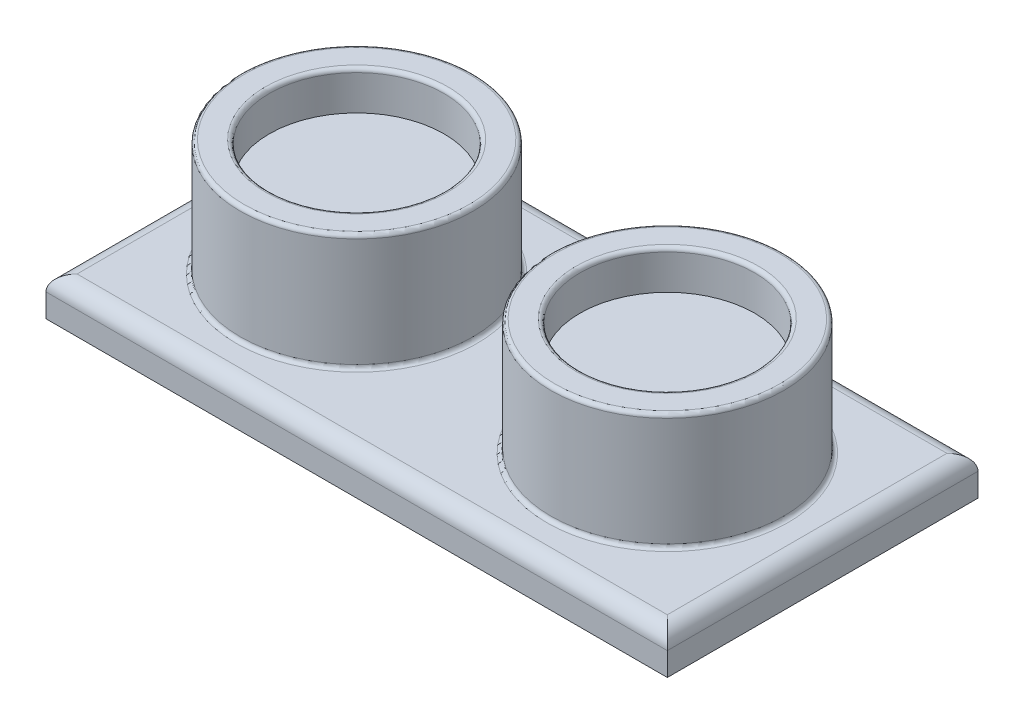
ISO-10303-21;
HEADER;
FILE_DESCRIPTION(('STEP AP214'),'2;1');
FILE_NAME('part.step','',(''),(''),'','','');
FILE_SCHEMA(('AUTOMOTIVE_DESIGN { 1 0 10303 214 1 1 1 1 }'));
ENDSEC;
DATA;
#1=APPLICATION_CONTEXT('core data for automotive mechanical design processes');
#2=APPLICATION_PROTOCOL_DEFINITION('international standard','automotive_design',2000,#1);
#3=PRODUCT_CONTEXT('',#1,'mechanical');
#4=PRODUCT('Part','Part','',(#3));
#5=PRODUCT_RELATED_PRODUCT_CATEGORY('part','',(#4));
#6=PRODUCT_DEFINITION_FORMATION('','',#4);
#7=PRODUCT_DEFINITION_CONTEXT('part definition',#1,'design');
#8=PRODUCT_DEFINITION('design','',#6,#7);
#9=PRODUCT_DEFINITION_SHAPE('','',#8);
#10=(LENGTH_UNIT() NAMED_UNIT(*) SI_UNIT(.MILLI.,.METRE.));
#11=(NAMED_UNIT(*) PLANE_ANGLE_UNIT() SI_UNIT($,.RADIAN.));
#12=(NAMED_UNIT(*) SI_UNIT($,.STERADIAN.) SOLID_ANGLE_UNIT());
#13=UNCERTAINTY_MEASURE_WITH_UNIT(LENGTH_MEASURE(1.E-05),#10,'distance_accuracy_value','');
#14=(GEOMETRIC_REPRESENTATION_CONTEXT(3) GLOBAL_UNCERTAINTY_ASSIGNED_CONTEXT((#13)) GLOBAL_UNIT_ASSIGNED_CONTEXT((#10,
#11,#12)) REPRESENTATION_CONTEXT('',''));
#15=CARTESIAN_POINT('',(0.,0.,0.));
#16=DIRECTION('',(0.,0.,1.));
#17=DIRECTION('',(1.,0.,0.));
#18=AXIS2_PLACEMENT_3D('',#15,#16,#17);
#19=CARTESIAN_POINT('',(40.,5.,-20.));
#20=DIRECTION('',(-1.,0.,0.));
#21=DIRECTION('',(0.,0.,1.));
#22=AXIS2_PLACEMENT_3D('',#19,#20,#21);
#23=PLANE('',#22);
#24=DIRECTION('',(0.,-1.,0.));
#25=VECTOR('',#24,1.);
#26=CARTESIAN_POINT('',(40.,5.,-20.));
#27=LINE('',#26,#25);
#28=CARTESIAN_POINT('',(40.,3.,-20.));
#29=VERTEX_POINT('',#28);
#30=CARTESIAN_POINT('',(40.,0.,-20.));
#31=VERTEX_POINT('',#30);
#32=EDGE_CURVE('E96',#29,#31,#27,.T.);
#33=ORIENTED_EDGE('',*,*,#32,.F.);
#34=DIRECTION('',(0.,0.,-1.));
#35=VECTOR('',#34,1.);
#36=CARTESIAN_POINT('',(40.,3.,20.));
#37=LINE('',#36,#35);
#38=CARTESIAN_POINT('',(40.,3.,20.));
#39=VERTEX_POINT('',#38);
#40=EDGE_CURVE('E155',#29,#39,#37,.F.);
#41=ORIENTED_EDGE('',*,*,#40,.T.);
#42=DIRECTION('',(0.,-1.,0.));
#43=VECTOR('',#42,1.);
#44=CARTESIAN_POINT('',(40.,5.,20.));
#45=LINE('',#44,#43);
#46=CARTESIAN_POINT('',(40.,0.,20.));
#47=VERTEX_POINT('',#46);
#48=EDGE_CURVE('E120',#39,#47,#45,.T.);
#49=ORIENTED_EDGE('',*,*,#48,.T.);
#50=DIRECTION('',(0.,0.,-1.));
#51=VECTOR('',#50,1.);
#52=CARTESIAN_POINT('',(40.,0.,-20.));
#53=LINE('',#52,#51);
#54=EDGE_CURVE('E115',#47,#31,#53,.T.);
#55=ORIENTED_EDGE('',*,*,#54,.T.);
#56=EDGE_LOOP('',(#33,#41,#49,#55));
#57=FACE_BOUND('',#56,.T.);
#58=ADVANCED_FACE('F41',(#57),#23,.F.);
#59=CARTESIAN_POINT('',(-40.,5.,-20.));
#60=DIRECTION('',(0.,0.,1.));
#61=DIRECTION('',(1.,0.,0.));
#62=AXIS2_PLACEMENT_3D('',#59,#60,#61);
#63=PLANE('',#62);
#64=DIRECTION('',(0.,-1.,0.));
#65=VECTOR('',#64,1.);
#66=CARTESIAN_POINT('',(-40.,5.,-20.));
#67=LINE('',#66,#65);
#68=CARTESIAN_POINT('',(-40.,3.,-20.));
#69=VERTEX_POINT('',#68);
#70=CARTESIAN_POINT('',(-40.,0.,-20.));
#71=VERTEX_POINT('',#70);
#72=EDGE_CURVE('E109',#69,#71,#67,.T.);
#73=ORIENTED_EDGE('',*,*,#72,.F.);
#74=DIRECTION('',(-1.,0.,0.));
#75=VECTOR('',#74,1.);
#76=CARTESIAN_POINT('',(40.,3.,-20.));
#77=LINE('',#76,#75);
#78=EDGE_CURVE('E102',#69,#29,#77,.F.);
#79=ORIENTED_EDGE('',*,*,#78,.T.);
#80=ORIENTED_EDGE('',*,*,#32,.T.);
#81=DIRECTION('',(-1.,0.,0.));
#82=VECTOR('',#81,1.);
#83=CARTESIAN_POINT('',(-40.,0.,-20.));
#84=LINE('',#83,#82);
#85=EDGE_CURVE('E99',#31,#71,#84,.T.);
#86=ORIENTED_EDGE('',*,*,#85,.T.);
#87=EDGE_LOOP('',(#73,#79,#80,#86));
#88=FACE_BOUND('',#87,.T.);
#89=ADVANCED_FACE('F98',(#88),#63,.F.);
#90=CARTESIAN_POINT('',(-40.,5.,-20.));
#91=DIRECTION('',(1.,0.,0.));
#92=DIRECTION('',(0.,0.,-1.));
#93=AXIS2_PLACEMENT_3D('',#90,#91,#92);
#94=PLANE('',#93);
#95=DIRECTION('',(0.,-1.,0.));
#96=VECTOR('',#95,1.);
#97=CARTESIAN_POINT('',(-40.,5.,20.));
#98=LINE('',#97,#96);
#99=CARTESIAN_POINT('',(-40.,3.,20.));
#100=VERTEX_POINT('',#99);
#101=CARTESIAN_POINT('',(-40.,0.,20.));
#102=VERTEX_POINT('',#101);
#103=EDGE_CURVE('E138',#100,#102,#98,.T.);
#104=ORIENTED_EDGE('',*,*,#103,.F.);
#105=DIRECTION('',(0.,0.,1.));
#106=VECTOR('',#105,1.);
#107=CARTESIAN_POINT('',(-40.,3.,-20.));
#108=LINE('',#107,#106);
#109=EDGE_CURVE('E57',#100,#69,#108,.F.);
#110=ORIENTED_EDGE('',*,*,#109,.T.);
#111=ORIENTED_EDGE('',*,*,#72,.T.);
#112=DIRECTION('',(0.,0.,1.));
#113=VECTOR('',#112,1.);
#114=CARTESIAN_POINT('',(-40.,0.,-20.));
#115=LINE('',#114,#113);
#116=EDGE_CURVE('E117',#71,#102,#115,.T.);
#117=ORIENTED_EDGE('',*,*,#116,.T.);
#118=EDGE_LOOP('',(#104,#110,#111,#117));
#119=FACE_BOUND('',#118,.T.);
#120=ADVANCED_FACE('F248',(#119),#94,.F.);
#121=CARTESIAN_POINT('',(-40.,5.,20.));
#122=DIRECTION('',(0.,0.,-1.));
#123=DIRECTION('',(-1.,0.,0.));
#124=AXIS2_PLACEMENT_3D('',#121,#122,#123);
#125=PLANE('',#124);
#126=ORIENTED_EDGE('',*,*,#48,.F.);
#127=DIRECTION('',(1.,0.,0.));
#128=VECTOR('',#127,1.);
#129=CARTESIAN_POINT('',(-40.,3.,20.));
#130=LINE('',#129,#128);
#131=EDGE_CURVE('E65',#39,#100,#130,.F.);
#132=ORIENTED_EDGE('',*,*,#131,.T.);
#133=ORIENTED_EDGE('',*,*,#103,.T.);
#134=DIRECTION('',(1.,0.,0.));
#135=VECTOR('',#134,1.);
#136=CARTESIAN_POINT('',(-40.,0.,20.));
#137=LINE('',#136,#135);
#138=EDGE_CURVE('E133',#102,#47,#137,.T.);
#139=ORIENTED_EDGE('',*,*,#138,.T.);
#140=EDGE_LOOP('',(#126,#132,#133,#139));
#141=FACE_BOUND('',#140,.T.);
#142=ADVANCED_FACE('F389',(#141),#125,.F.);
#143=CARTESIAN_POINT('',(0.,5.,0.));
#144=DIRECTION('',(0.,1.,0.));
#145=DIRECTION('',(0.,0.,1.));
#146=AXIS2_PLACEMENT_3D('',#143,#144,#145);
#147=PLANE('',#146);
#148=CARTESIAN_POINT('',(20.,5.,0.));
#149=DIRECTION('',(0.,1.,0.));
#150=DIRECTION('',(0.,0.,1.));
#151=AXIS2_PLACEMENT_3D('',#148,#149,#150);
#152=CIRCLE('',#151,15.5);
#153=CARTESIAN_POINT('',(20.,5.,15.5));
#154=VERTEX_POINT('',#153);
#155=EDGE_CURVE('E11',#154,#154,#152,.F.);
#156=ORIENTED_EDGE('',*,*,#155,.T.);
#157=EDGE_LOOP('',(#156));
#158=FACE_BOUND('',#157,.T.);
#159=CARTESIAN_POINT('',(-20.,5.,0.));
#160=DIRECTION('',(0.,1.,0.));
#161=DIRECTION('',(0.,0.,1.));
#162=AXIS2_PLACEMENT_3D('',#159,#160,#161);
#163=CIRCLE('',#162,15.5);
#164=CARTESIAN_POINT('',(-20.,5.,15.5));
#165=VERTEX_POINT('',#164);
#166=EDGE_CURVE('E50',#165,#165,#163,.F.);
#167=ORIENTED_EDGE('',*,*,#166,.T.);
#168=EDGE_LOOP('',(#167));
#169=FACE_BOUND('',#168,.T.);
#170=DIRECTION('',(1.,0.,0.));
#171=VECTOR('',#170,1.);
#172=CARTESIAN_POINT('',(40.,5.,18.));
#173=LINE('',#172,#171);
#174=CARTESIAN_POINT('',(-38.,5.,18.));
#175=VERTEX_POINT('',#174);
#176=CARTESIAN_POINT('',(38.,5.,18.));
#177=VERTEX_POINT('',#176);
#178=EDGE_CURVE('E148',#175,#177,#173,.T.);
#179=ORIENTED_EDGE('',*,*,#178,.T.);
#180=DIRECTION('',(0.,0.,-1.));
#181=VECTOR('',#180,1.);
#182=CARTESIAN_POINT('',(38.,5.,-20.));
#183=LINE('',#182,#181);
#184=CARTESIAN_POINT('',(38.,5.,-18.));
#185=VERTEX_POINT('',#184);
#186=EDGE_CURVE('E151',#177,#185,#183,.T.);
#187=ORIENTED_EDGE('',*,*,#186,.T.);
#188=DIRECTION('',(-1.,0.,0.));
#189=VECTOR('',#188,1.);
#190=CARTESIAN_POINT('',(-40.,5.,-18.));
#191=LINE('',#190,#189);
#192=CARTESIAN_POINT('',(-38.,5.,-18.));
#193=VERTEX_POINT('',#192);
#194=EDGE_CURVE('E108',#185,#193,#191,.T.);
#195=ORIENTED_EDGE('',*,*,#194,.T.);
#196=DIRECTION('',(0.,0.,1.));
#197=VECTOR('',#196,1.);
#198=CARTESIAN_POINT('',(-38.,5.,20.));
#199=LINE('',#198,#197);
#200=EDGE_CURVE('E145',#193,#175,#199,.T.);
#201=ORIENTED_EDGE('',*,*,#200,.T.);
#202=EDGE_LOOP('',(#179,#187,#195,#201));
#203=FACE_BOUND('',#202,.T.);
#204=ADVANCED_FACE('F221',(#158,#169,#203),#147,.T.);
#205=CARTESIAN_POINT('',(0.,0.,0.));
#206=DIRECTION('',(0.,1.,0.));
#207=DIRECTION('',(0.,0.,1.));
#208=AXIS2_PLACEMENT_3D('',#205,#206,#207);
#209=PLANE('',#208);
#210=ORIENTED_EDGE('',*,*,#54,.F.);
#211=ORIENTED_EDGE('',*,*,#138,.F.);
#212=ORIENTED_EDGE('',*,*,#116,.F.);
#213=ORIENTED_EDGE('',*,*,#85,.F.);
#214=EDGE_LOOP('',(#210,#211,#212,#213));
#215=FACE_BOUND('',#214,.T.);
#216=ADVANCED_FACE('F113',(#215),#209,.F.);
#217=CARTESIAN_POINT('',(-20.,20.,0.));
#218=DIRECTION('',(0.,-1.,0.));
#219=DIRECTION('',(0.,0.,-1.));
#220=AXIS2_PLACEMENT_3D('',#217,#218,#219);
#221=CYLINDRICAL_SURFACE('',#220,15.);
#222=CARTESIAN_POINT('',(-20.,19.5,0.));
#223=DIRECTION('',(0.,1.,0.));
#224=DIRECTION('',(0.,0.,1.));
#225=AXIS2_PLACEMENT_3D('',#222,#223,#224);
#226=CIRCLE('',#225,15.);
#227=CARTESIAN_POINT('',(-20.,19.5,15.));
#228=VERTEX_POINT('',#227);
#229=EDGE_CURVE('E214',#228,#228,#226,.F.);
#230=ORIENTED_EDGE('',*,*,#229,.T.);
#231=EDGE_LOOP('',(#230));
#232=FACE_BOUND('',#231,.T.);
#233=CARTESIAN_POINT('',(-20.,5.5,0.));
#234=DIRECTION('',(0.,1.,0.));
#235=DIRECTION('',(0.,0.,1.));
#236=AXIS2_PLACEMENT_3D('',#233,#234,#235);
#237=CIRCLE('',#236,15.);
#238=CARTESIAN_POINT('',(-20.,5.5,15.));
#239=VERTEX_POINT('',#238);
#240=EDGE_CURVE('E210',#239,#239,#237,.T.);
#241=ORIENTED_EDGE('',*,*,#240,.T.);
#242=EDGE_LOOP('',(#241));
#243=FACE_BOUND('',#242,.T.);
#244=ADVANCED_FACE('F229',(#232,#243),#221,.T.);
#245=CARTESIAN_POINT('',(-20.,20.,0.));
#246=DIRECTION('',(0.,1.,0.));
#247=DIRECTION('',(0.,0.,1.));
#248=AXIS2_PLACEMENT_3D('',#245,#246,#247);
#249=PLANE('',#248);
#250=CARTESIAN_POINT('',(-20.,20.,0.));
#251=DIRECTION('',(0.,1.,0.));
#252=DIRECTION('',(0.,0.,1.));
#253=AXIS2_PLACEMENT_3D('',#250,#251,#252);
#254=CIRCLE('',#253,11.75);
#255=CARTESIAN_POINT('',(-20.,20.,11.75));
#256=VERTEX_POINT('',#255);
#257=EDGE_CURVE('E186',#256,#256,#254,.F.);
#258=ORIENTED_EDGE('',*,*,#257,.T.);
#259=EDGE_LOOP('',(#258));
#260=FACE_BOUND('',#259,.T.);
#261=CARTESIAN_POINT('',(-20.,20.,0.));
#262=DIRECTION('',(0.,1.,0.));
#263=DIRECTION('',(0.,0.,1.));
#264=AXIS2_PLACEMENT_3D('',#261,#262,#263);
#265=CIRCLE('',#264,14.5);
#266=CARTESIAN_POINT('',(-20.,20.,14.5));
#267=VERTEX_POINT('',#266);
#268=EDGE_CURVE('E182',#267,#267,#265,.T.);
#269=ORIENTED_EDGE('',*,*,#268,.T.);
#270=EDGE_LOOP('',(#269));
#271=FACE_BOUND('',#270,.T.);
#272=ADVANCED_FACE('F231',(#260,#271),#249,.T.);
#273=CARTESIAN_POINT('',(20.,20.,0.));
#274=DIRECTION('',(0.,-1.,0.));
#275=DIRECTION('',(0.,0.,-1.));
#276=AXIS2_PLACEMENT_3D('',#273,#274,#275);
#277=CYLINDRICAL_SURFACE('',#276,15.);
#278=CARTESIAN_POINT('',(20.,19.5,0.));
#279=DIRECTION('',(0.,1.,0.));
#280=DIRECTION('',(0.,0.,1.));
#281=AXIS2_PLACEMENT_3D('',#278,#279,#280);
#282=CIRCLE('',#281,15.);
#283=CARTESIAN_POINT('',(20.,19.5,15.));
#284=VERTEX_POINT('',#283);
#285=EDGE_CURVE('E206',#284,#284,#282,.F.);
#286=ORIENTED_EDGE('',*,*,#285,.T.);
#287=EDGE_LOOP('',(#286));
#288=FACE_BOUND('',#287,.T.);
#289=CARTESIAN_POINT('',(20.,5.5,0.));
#290=DIRECTION('',(0.,1.,0.));
#291=DIRECTION('',(0.,0.,1.));
#292=AXIS2_PLACEMENT_3D('',#289,#290,#291);
#293=CIRCLE('',#292,15.);
#294=CARTESIAN_POINT('',(20.,5.5,15.));
#295=VERTEX_POINT('',#294);
#296=EDGE_CURVE('E202',#295,#295,#293,.T.);
#297=ORIENTED_EDGE('',*,*,#296,.T.);
#298=EDGE_LOOP('',(#297));
#299=FACE_BOUND('',#298,.T.);
#300=ADVANCED_FACE('F238',(#288,#299),#277,.T.);
#301=CARTESIAN_POINT('',(20.,20.,0.));
#302=DIRECTION('',(0.,1.,0.));
#303=DIRECTION('',(0.,0.,1.));
#304=AXIS2_PLACEMENT_3D('',#301,#302,#303);
#305=PLANE('',#304);
#306=CARTESIAN_POINT('',(20.,20.,0.));
#307=DIRECTION('',(0.,1.,0.));
#308=DIRECTION('',(0.,0.,1.));
#309=AXIS2_PLACEMENT_3D('',#306,#307,#308);
#310=CIRCLE('',#309,11.75);
#311=CARTESIAN_POINT('',(20.,20.,11.75));
#312=VERTEX_POINT('',#311);
#313=EDGE_CURVE('E198',#312,#312,#310,.F.);
#314=ORIENTED_EDGE('',*,*,#313,.T.);
#315=EDGE_LOOP('',(#314));
#316=FACE_BOUND('',#315,.T.);
#317=CARTESIAN_POINT('',(20.,20.,0.));
#318=DIRECTION('',(0.,1.,0.));
#319=DIRECTION('',(0.,0.,1.));
#320=AXIS2_PLACEMENT_3D('',#317,#318,#319);
#321=CIRCLE('',#320,14.5);
#322=CARTESIAN_POINT('',(20.,20.,14.5));
#323=VERTEX_POINT('',#322);
#324=EDGE_CURVE('E194',#323,#323,#321,.T.);
#325=ORIENTED_EDGE('',*,*,#324,.T.);
#326=EDGE_LOOP('',(#325));
#327=FACE_BOUND('',#326,.T.);
#328=ADVANCED_FACE('F293',(#316,#327),#305,.T.);
#329=CARTESIAN_POINT('',(20.,15.,0.));
#330=DIRECTION('',(0.,1.,0.));
#331=DIRECTION('',(0.,0.,1.));
#332=AXIS2_PLACEMENT_3D('',#329,#330,#331);
#333=CYLINDRICAL_SURFACE('',#332,11.25);
#334=CARTESIAN_POINT('',(20.,19.5,0.));
#335=DIRECTION('',(0.,1.,0.));
#336=DIRECTION('',(0.,0.,1.));
#337=AXIS2_PLACEMENT_3D('',#334,#335,#336);
#338=CIRCLE('',#337,11.25);
#339=CARTESIAN_POINT('',(20.,19.5,11.25));
#340=VERTEX_POINT('',#339);
#341=EDGE_CURVE('E190',#340,#340,#338,.T.);
#342=ORIENTED_EDGE('',*,*,#341,.T.);
#343=EDGE_LOOP('',(#342));
#344=FACE_BOUND('',#343,.T.);
#345=CARTESIAN_POINT('',(20.,15.,0.));
#346=DIRECTION('',(0.,1.,0.));
#347=DIRECTION('',(0.,0.,1.));
#348=AXIS2_PLACEMENT_3D('',#345,#346,#347);
#349=CIRCLE('',#348,11.25);
#350=CARTESIAN_POINT('',(20.,15.,11.25));
#351=VERTEX_POINT('',#350);
#352=EDGE_CURVE('E127',#351,#351,#349,.T.);
#353=ORIENTED_EDGE('',*,*,#352,.F.);
#354=EDGE_LOOP('',(#353));
#355=FACE_BOUND('',#354,.T.);
#356=ADVANCED_FACE('F299',(#344,#355),#333,.F.);
#357=CARTESIAN_POINT('',(20.,15.,0.));
#358=DIRECTION('',(0.,1.,0.));
#359=DIRECTION('',(0.,0.,1.));
#360=AXIS2_PLACEMENT_3D('',#357,#358,#359);
#361=PLANE('',#360);
#362=ORIENTED_EDGE('',*,*,#352,.T.);
#363=EDGE_LOOP('',(#362));
#364=FACE_BOUND('',#363,.T.);
#365=ADVANCED_FACE('F305',(#364),#361,.T.);
#366=CARTESIAN_POINT('',(-20.,15.,0.));
#367=DIRECTION('',(0.,1.,0.));
#368=DIRECTION('',(0.,0.,1.));
#369=AXIS2_PLACEMENT_3D('',#366,#367,#368);
#370=CYLINDRICAL_SURFACE('',#369,11.25);
#371=CARTESIAN_POINT('',(-20.,19.5,0.));
#372=DIRECTION('',(0.,1.,0.));
#373=DIRECTION('',(0.,0.,1.));
#374=AXIS2_PLACEMENT_3D('',#371,#372,#373);
#375=CIRCLE('',#374,11.25);
#376=CARTESIAN_POINT('',(-20.,19.5,11.25));
#377=VERTEX_POINT('',#376);
#378=EDGE_CURVE('E164',#377,#377,#375,.T.);
#379=ORIENTED_EDGE('',*,*,#378,.T.);
#380=EDGE_LOOP('',(#379));
#381=FACE_BOUND('',#380,.T.);
#382=CARTESIAN_POINT('',(-20.,15.,0.));
#383=DIRECTION('',(0.,1.,0.));
#384=DIRECTION('',(0.,0.,1.));
#385=AXIS2_PLACEMENT_3D('',#382,#383,#384);
#386=CIRCLE('',#385,11.25);
#387=CARTESIAN_POINT('',(-20.,15.,11.25));
#388=VERTEX_POINT('',#387);
#389=EDGE_CURVE('E123',#388,#388,#386,.T.);
#390=ORIENTED_EDGE('',*,*,#389,.F.);
#391=EDGE_LOOP('',(#390));
#392=FACE_BOUND('',#391,.T.);
#393=ADVANCED_FACE('F309',(#381,#392),#370,.F.);
#394=CARTESIAN_POINT('',(-20.,15.,0.));
#395=DIRECTION('',(0.,1.,0.));
#396=DIRECTION('',(0.,0.,1.));
#397=AXIS2_PLACEMENT_3D('',#394,#395,#396);
#398=PLANE('',#397);
#399=ORIENTED_EDGE('',*,*,#389,.T.);
#400=EDGE_LOOP('',(#399));
#401=FACE_BOUND('',#400,.T.);
#402=ADVANCED_FACE('F268',(#401),#398,.T.);
#403=CARTESIAN_POINT('',(-38.,3.,0.));
#404=DIRECTION('',(0.,0.,-1.));
#405=DIRECTION('',(-1.,0.,0.));
#406=AXIS2_PLACEMENT_3D('',#403,#404,#405);
#407=CYLINDRICAL_SURFACE('',#406,2.);
#408=CARTESIAN_POINT('',(-38.,3.,-18.));
#409=DIRECTION('',(0.707106781186547,0.,-0.707106781186548));
#410=DIRECTION('',(0.707106781186548,0.,0.707106781186547));
#411=AXIS2_PLACEMENT_3D('',#408,#409,#410);
#412=ELLIPSE('',#411,2.82842712474619,2.);
#413=EDGE_CURVE('E171',#69,#193,#412,.T.);
#414=ORIENTED_EDGE('',*,*,#413,.F.);
#415=ORIENTED_EDGE('',*,*,#109,.F.);
#416=CARTESIAN_POINT('',(-38.,3.,18.));
#417=DIRECTION('',(-0.707106781186548,0.,-0.707106781186547));
#418=DIRECTION('',(0.707106781186547,0.,-0.707106781186548));
#419=AXIS2_PLACEMENT_3D('',#416,#417,#418);
#420=ELLIPSE('',#419,2.82842712474619,2.);
#421=EDGE_CURVE('E175',#175,#100,#420,.F.);
#422=ORIENTED_EDGE('',*,*,#421,.F.);
#423=ORIENTED_EDGE('',*,*,#200,.F.);
#424=EDGE_LOOP('',(#414,#415,#422,#423));
#425=FACE_BOUND('',#424,.T.);
#426=ADVANCED_FACE('F264',(#425),#407,.T.);
#427=CARTESIAN_POINT('',(0.,3.,18.));
#428=DIRECTION('',(-1.,0.,0.));
#429=DIRECTION('',(0.,0.,1.));
#430=AXIS2_PLACEMENT_3D('',#427,#428,#429);
#431=CYLINDRICAL_SURFACE('',#430,2.);
#432=ORIENTED_EDGE('',*,*,#421,.T.);
#433=ORIENTED_EDGE('',*,*,#131,.F.);
#434=CARTESIAN_POINT('',(38.,3.,18.));
#435=DIRECTION('',(-0.707106781186547,0.,0.707106781186548));
#436=DIRECTION('',(-0.707106781186548,0.,-0.707106781186547));
#437=AXIS2_PLACEMENT_3D('',#434,#435,#436);
#438=ELLIPSE('',#437,2.82842712474619,2.);
#439=EDGE_CURVE('E168',#177,#39,#438,.F.);
#440=ORIENTED_EDGE('',*,*,#439,.F.);
#441=ORIENTED_EDGE('',*,*,#178,.F.);
#442=EDGE_LOOP('',(#432,#433,#440,#441));
#443=FACE_BOUND('',#442,.T.);
#444=ADVANCED_FACE('F260',(#443),#431,.T.);
#445=CARTESIAN_POINT('',(0.,3.,-18.));
#446=DIRECTION('',(1.,0.,0.));
#447=DIRECTION('',(0.,0.,-1.));
#448=AXIS2_PLACEMENT_3D('',#445,#446,#447);
#449=CYLINDRICAL_SURFACE('',#448,2.);
#450=ORIENTED_EDGE('',*,*,#413,.T.);
#451=ORIENTED_EDGE('',*,*,#194,.F.);
#452=CARTESIAN_POINT('',(38.,3.,-18.));
#453=DIRECTION('',(0.707106781186548,0.,0.707106781186547));
#454=DIRECTION('',(0.707106781186547,0.,-0.707106781186548));
#455=AXIS2_PLACEMENT_3D('',#452,#453,#454);
#456=ELLIPSE('',#455,2.82842712474619,2.);
#457=EDGE_CURVE('E165',#29,#185,#456,.T.);
#458=ORIENTED_EDGE('',*,*,#457,.F.);
#459=ORIENTED_EDGE('',*,*,#78,.F.);
#460=EDGE_LOOP('',(#450,#451,#458,#459));
#461=FACE_BOUND('',#460,.T.);
#462=ADVANCED_FACE('F256',(#461),#449,.T.);
#463=CARTESIAN_POINT('',(38.,3.,0.));
#464=DIRECTION('',(0.,0.,1.));
#465=DIRECTION('',(1.,0.,0.));
#466=AXIS2_PLACEMENT_3D('',#463,#464,#465);
#467=CYLINDRICAL_SURFACE('',#466,2.);
#468=ORIENTED_EDGE('',*,*,#439,.T.);
#469=ORIENTED_EDGE('',*,*,#40,.F.);
#470=ORIENTED_EDGE('',*,*,#457,.T.);
#471=ORIENTED_EDGE('',*,*,#186,.F.);
#472=EDGE_LOOP('',(#468,#469,#470,#471));
#473=FACE_BOUND('',#472,.T.);
#474=ADVANCED_FACE('F252',(#473),#467,.T.);
#475=CARTESIAN_POINT('',(-20.,19.5,0.));
#476=DIRECTION('',(0.,1.,0.));
#477=DIRECTION('',(0.,0.,1.));
#478=AXIS2_PLACEMENT_3D('',#475,#476,#477);
#479=TOROIDAL_SURFACE('',#478,11.75,0.5);
#480=ORIENTED_EDGE('',*,*,#257,.F.);
#481=EDGE_LOOP('',(#480));
#482=FACE_BOUND('',#481,.T.);
#483=ORIENTED_EDGE('',*,*,#378,.F.);
#484=EDGE_LOOP('',(#483));
#485=FACE_BOUND('',#484,.T.);
#486=ADVANCED_FACE('F255',(#482,#485),#479,.T.);
#487=CARTESIAN_POINT('',(20.,19.5,0.));
#488=DIRECTION('',(0.,1.,0.));
#489=DIRECTION('',(0.,0.,1.));
#490=AXIS2_PLACEMENT_3D('',#487,#488,#489);
#491=TOROIDAL_SURFACE('',#490,11.75,0.5);
#492=ORIENTED_EDGE('',*,*,#313,.F.);
#493=EDGE_LOOP('',(#492));
#494=FACE_BOUND('',#493,.T.);
#495=ORIENTED_EDGE('',*,*,#341,.F.);
#496=EDGE_LOOP('',(#495));
#497=FACE_BOUND('',#496,.T.);
#498=ADVANCED_FACE('F272',(#494,#497),#491,.T.);
#499=CARTESIAN_POINT('',(20.,19.5,0.));
#500=DIRECTION('',(0.,1.,0.));
#501=DIRECTION('',(0.,0.,1.));
#502=AXIS2_PLACEMENT_3D('',#499,#500,#501);
#503=TOROIDAL_SURFACE('',#502,14.5,0.5);
#504=ORIENTED_EDGE('',*,*,#285,.F.);
#505=EDGE_LOOP('',(#504));
#506=FACE_BOUND('',#505,.T.);
#507=ORIENTED_EDGE('',*,*,#324,.F.);
#508=EDGE_LOOP('',(#507));
#509=FACE_BOUND('',#508,.T.);
#510=ADVANCED_FACE('F276',(#506,#509),#503,.T.);
#511=CARTESIAN_POINT('',(-20.,19.5,0.));
#512=DIRECTION('',(0.,1.,0.));
#513=DIRECTION('',(0.,0.,1.));
#514=AXIS2_PLACEMENT_3D('',#511,#512,#513);
#515=TOROIDAL_SURFACE('',#514,14.5,0.5);
#516=ORIENTED_EDGE('',*,*,#229,.F.);
#517=EDGE_LOOP('',(#516));
#518=FACE_BOUND('',#517,.T.);
#519=ORIENTED_EDGE('',*,*,#268,.F.);
#520=EDGE_LOOP('',(#519));
#521=FACE_BOUND('',#520,.T.);
#522=ADVANCED_FACE('F280',(#518,#521),#515,.T.);
#523=CARTESIAN_POINT('',(20.,5.5,0.));
#524=DIRECTION('',(0.,1.,0.));
#525=DIRECTION('',(0.,0.,1.));
#526=AXIS2_PLACEMENT_3D('',#523,#524,#525);
#527=TOROIDAL_SURFACE('',#526,15.5,0.5);
#528=ORIENTED_EDGE('',*,*,#155,.F.);
#529=EDGE_LOOP('',(#528));
#530=FACE_BOUND('',#529,.T.);
#531=ORIENTED_EDGE('',*,*,#296,.F.);
#532=EDGE_LOOP('',(#531));
#533=FACE_BOUND('',#532,.T.);
#534=ADVANCED_FACE('F226',(#530,#533),#527,.F.);
#535=CARTESIAN_POINT('',(-20.,5.5,0.));
#536=DIRECTION('',(0.,1.,0.));
#537=DIRECTION('',(0.,0.,1.));
#538=AXIS2_PLACEMENT_3D('',#535,#536,#537);
#539=TOROIDAL_SURFACE('',#538,15.5,0.5);
#540=ORIENTED_EDGE('',*,*,#166,.F.);
#541=EDGE_LOOP('',(#540));
#542=FACE_BOUND('',#541,.T.);
#543=ORIENTED_EDGE('',*,*,#240,.F.);
#544=EDGE_LOOP('',(#543));
#545=FACE_BOUND('',#544,.T.);
#546=ADVANCED_FACE('F43',(#542,#545),#539,.F.);
#547=CLOSED_SHELL('',(#58,#89,#120,#142,#204,#216,#244,#272,#300,#328,#356,#365,#393,#402,#426,
#444,#462,#474,#486,#498,#510,#522,#534,#546));
#548=MANIFOLD_SOLID_BREP('B2',#547);
#549=ADVANCED_BREP_SHAPE_REPRESENTATION('',(#18,#548),#14);
#550=SHAPE_DEFINITION_REPRESENTATION(#9,#549);
ENDSEC;
END-ISO-10303-21;
